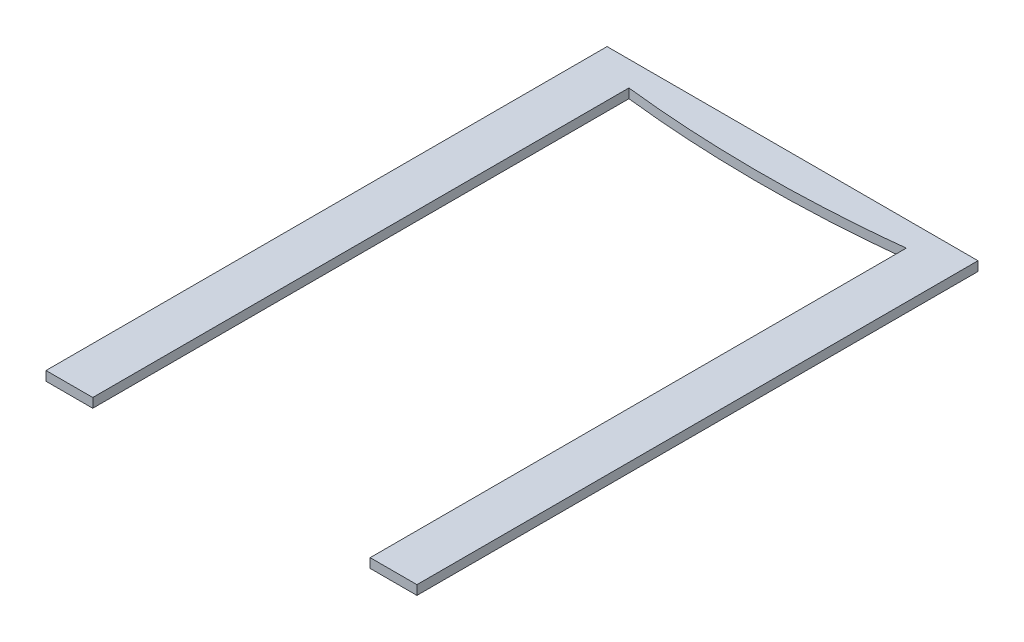
ISO-10303-21;
HEADER;
FILE_DESCRIPTION(('STEP AP214'),'2;1');
FILE_NAME('part.step','',(''),(''),'','','');
FILE_SCHEMA(('AUTOMOTIVE_DESIGN { 1 0 10303 214 1 1 1 1 }'));
ENDSEC;
DATA;
#1=APPLICATION_CONTEXT('core data for automotive mechanical design processes');
#2=APPLICATION_PROTOCOL_DEFINITION('international standard','automotive_design',2000,#1);
#3=PRODUCT_CONTEXT('',#1,'mechanical');
#4=PRODUCT('Part','Part','',(#3));
#5=PRODUCT_RELATED_PRODUCT_CATEGORY('part','',(#4));
#6=PRODUCT_DEFINITION_FORMATION('','',#4);
#7=PRODUCT_DEFINITION_CONTEXT('part definition',#1,'design');
#8=PRODUCT_DEFINITION('design','',#6,#7);
#9=PRODUCT_DEFINITION_SHAPE('','',#8);
#10=(LENGTH_UNIT() NAMED_UNIT(*) SI_UNIT(.MILLI.,.METRE.));
#11=(NAMED_UNIT(*) PLANE_ANGLE_UNIT() SI_UNIT($,.RADIAN.));
#12=(NAMED_UNIT(*) SI_UNIT($,.STERADIAN.) SOLID_ANGLE_UNIT());
#13=UNCERTAINTY_MEASURE_WITH_UNIT(LENGTH_MEASURE(1.E-05),#10,'distance_accuracy_value','');
#14=(GEOMETRIC_REPRESENTATION_CONTEXT(3) GLOBAL_UNCERTAINTY_ASSIGNED_CONTEXT((#13)) GLOBAL_UNIT_ASSIGNED_CONTEXT((#10,
#11,#12)) REPRESENTATION_CONTEXT('',''));
#15=CARTESIAN_POINT('',(0.,0.,0.));
#16=DIRECTION('',(0.,0.,1.));
#17=DIRECTION('',(1.,0.,0.));
#18=AXIS2_PLACEMENT_3D('',#15,#16,#17);
#19=CARTESIAN_POINT('',(-44.5,3.,90.));
#20=DIRECTION('',(0.,0.,-1.));
#21=DIRECTION('',(-1.,0.,0.));
#22=AXIS2_PLACEMENT_3D('',#19,#20,#21);
#23=PLANE('',#22);
#24=DIRECTION('',(1.,0.,0.));
#25=VECTOR('',#24,1.);
#26=CARTESIAN_POINT('',(-44.5,0.,90.));
#27=LINE('',#26,#25);
#28=CARTESIAN_POINT('',(-59.5,0.,90.));
#29=VERTEX_POINT('',#28);
#30=CARTESIAN_POINT('',(-44.5,0.,90.));
#31=VERTEX_POINT('',#30);
#32=EDGE_CURVE('E129',#29,#31,#27,.T.);
#33=ORIENTED_EDGE('',*,*,#32,.T.);
#34=DIRECTION('',(0.,-1.,0.));
#35=VECTOR('',#34,1.);
#36=CARTESIAN_POINT('',(-44.5,3.,90.));
#37=LINE('',#36,#35);
#38=CARTESIAN_POINT('',(-44.5,3.,90.));
#39=VERTEX_POINT('',#38);
#40=EDGE_CURVE('E11',#39,#31,#37,.T.);
#41=ORIENTED_EDGE('',*,*,#40,.F.);
#42=DIRECTION('',(1.,0.,0.));
#43=VECTOR('',#42,1.);
#44=CARTESIAN_POINT('',(-44.5,3.,90.));
#45=LINE('',#44,#43);
#46=CARTESIAN_POINT('',(-59.5,3.,90.));
#47=VERTEX_POINT('',#46);
#48=EDGE_CURVE('E148',#47,#39,#45,.T.);
#49=ORIENTED_EDGE('',*,*,#48,.F.);
#50=DIRECTION('',(0.,-1.,0.));
#51=VECTOR('',#50,1.);
#52=CARTESIAN_POINT('',(-59.5,3.,90.));
#53=LINE('',#52,#51);
#54=EDGE_CURVE('E125',#47,#29,#53,.T.);
#55=ORIENTED_EDGE('',*,*,#54,.T.);
#56=EDGE_LOOP('',(#33,#41,#49,#55));
#57=FACE_BOUND('',#56,.T.);
#58=ADVANCED_FACE('F33',(#57),#23,.F.);
#59=CARTESIAN_POINT('',(-44.5,3.,-82.));
#60=DIRECTION('',(-1.,0.,0.));
#61=DIRECTION('',(0.,0.,1.));
#62=AXIS2_PLACEMENT_3D('',#59,#60,#61);
#63=PLANE('',#62);
#64=DIRECTION('',(0.,0.,-1.));
#65=VECTOR('',#64,1.);
#66=CARTESIAN_POINT('',(-44.5,0.,-82.));
#67=LINE('',#66,#65);
#68=CARTESIAN_POINT('',(-44.5,0.,-82.));
#69=VERTEX_POINT('',#68);
#70=EDGE_CURVE('E132',#31,#69,#67,.T.);
#71=ORIENTED_EDGE('',*,*,#70,.T.);
#72=DIRECTION('',(0.,-1.,0.));
#73=VECTOR('',#72,1.);
#74=CARTESIAN_POINT('',(-44.5,3.,-82.));
#75=LINE('',#74,#73);
#76=CARTESIAN_POINT('',(-44.5,3.,-82.));
#77=VERTEX_POINT('',#76);
#78=EDGE_CURVE('E41',#77,#69,#75,.T.);
#79=ORIENTED_EDGE('',*,*,#78,.F.);
#80=DIRECTION('',(0.,0.,-1.));
#81=VECTOR('',#80,1.);
#82=CARTESIAN_POINT('',(-44.5,3.,-82.));
#83=LINE('',#82,#81);
#84=EDGE_CURVE('E92',#39,#77,#83,.T.);
#85=ORIENTED_EDGE('',*,*,#84,.F.);
#86=ORIENTED_EDGE('',*,*,#40,.T.);
#87=EDGE_LOOP('',(#71,#79,#85,#86));
#88=FACE_BOUND('',#87,.T.);
#89=ADVANCED_FACE('F189',(#88),#63,.F.);
#90=CARTESIAN_POINT('',(-44.5,3.,-82.));
#91=CARTESIAN_POINT('',(0.,3.,-77.));
#92=CARTESIAN_POINT('',(44.5,3.,-82.));
#93=B_SPLINE_CURVE_WITH_KNOTS('',2,(#90,#91,#92),.UNSPECIFIED.,.F.,.F.,(3,3),(0.,1.),.UNSPECIFIED.);
#94=DIRECTION('',(0.,-1.,0.));
#95=VECTOR('',#94,1.);
#96=SURFACE_OF_LINEAR_EXTRUSION('',#93,#95);
#97=CARTESIAN_POINT('',(-44.5,0.,-82.));
#98=CARTESIAN_POINT('',(0.,0.,-77.));
#99=CARTESIAN_POINT('',(44.5,0.,-82.));
#100=B_SPLINE_CURVE_WITH_KNOTS('',2,(#97,#98,#99),.UNSPECIFIED.,.F.,.F.,(3,3),(0.,1.),.UNSPECIFIED.);
#101=CARTESIAN_POINT('',(44.5,0.,-82.));
#102=VERTEX_POINT('',#101);
#103=EDGE_CURVE('E134',#69,#102,#100,.T.);
#104=ORIENTED_EDGE('',*,*,#103,.T.);
#105=DIRECTION('',(0.,-1.,0.));
#106=VECTOR('',#105,1.);
#107=CARTESIAN_POINT('',(44.5,3.,-82.));
#108=LINE('',#107,#106);
#109=CARTESIAN_POINT('',(44.5,3.,-82.));
#110=VERTEX_POINT('',#109);
#111=EDGE_CURVE('E155',#110,#102,#108,.T.);
#112=ORIENTED_EDGE('',*,*,#111,.F.);
#113=EDGE_CURVE('E163',#77,#110,#93,.T.);
#114=ORIENTED_EDGE('',*,*,#113,.F.);
#115=ORIENTED_EDGE('',*,*,#78,.T.);
#116=EDGE_LOOP('',(#104,#112,#114,#115));
#117=FACE_BOUND('',#116,.T.);
#118=ADVANCED_FACE('F161',(#117),#96,.F.);
#119=CARTESIAN_POINT('',(44.5,3.,90.));
#120=DIRECTION('',(1.,0.,0.));
#121=DIRECTION('',(0.,0.,-1.));
#122=AXIS2_PLACEMENT_3D('',#119,#120,#121);
#123=PLANE('',#122);
#124=DIRECTION('',(0.,0.,1.));
#125=VECTOR('',#124,1.);
#126=CARTESIAN_POINT('',(44.5,0.,90.));
#127=LINE('',#126,#125);
#128=CARTESIAN_POINT('',(44.5,0.,90.));
#129=VERTEX_POINT('',#128);
#130=EDGE_CURVE('E138',#102,#129,#127,.T.);
#131=ORIENTED_EDGE('',*,*,#130,.T.);
#132=DIRECTION('',(0.,-1.,0.));
#133=VECTOR('',#132,1.);
#134=CARTESIAN_POINT('',(44.5,3.,90.));
#135=LINE('',#134,#133);
#136=CARTESIAN_POINT('',(44.5,3.,90.));
#137=VERTEX_POINT('',#136);
#138=EDGE_CURVE('E152',#137,#129,#135,.T.);
#139=ORIENTED_EDGE('',*,*,#138,.F.);
#140=DIRECTION('',(0.,0.,1.));
#141=VECTOR('',#140,1.);
#142=CARTESIAN_POINT('',(44.5,3.,90.));
#143=LINE('',#142,#141);
#144=EDGE_CURVE('E175',#110,#137,#143,.T.);
#145=ORIENTED_EDGE('',*,*,#144,.F.);
#146=ORIENTED_EDGE('',*,*,#111,.T.);
#147=EDGE_LOOP('',(#131,#139,#145,#146));
#148=FACE_BOUND('',#147,.T.);
#149=ADVANCED_FACE('F171',(#148),#123,.F.);
#150=CARTESIAN_POINT('',(59.5,3.,90.));
#151=DIRECTION('',(0.,0.,-1.));
#152=DIRECTION('',(-1.,0.,0.));
#153=AXIS2_PLACEMENT_3D('',#150,#151,#152);
#154=PLANE('',#153);
#155=DIRECTION('',(1.,0.,0.));
#156=VECTOR('',#155,1.);
#157=CARTESIAN_POINT('',(59.5,0.,90.));
#158=LINE('',#157,#156);
#159=CARTESIAN_POINT('',(59.5,0.,90.));
#160=VERTEX_POINT('',#159);
#161=EDGE_CURVE('E143',#129,#160,#158,.T.);
#162=ORIENTED_EDGE('',*,*,#161,.T.);
#163=DIRECTION('',(0.,-1.,0.));
#164=VECTOR('',#163,1.);
#165=CARTESIAN_POINT('',(59.5,3.,90.));
#166=LINE('',#165,#164);
#167=CARTESIAN_POINT('',(59.5,3.,90.));
#168=VERTEX_POINT('',#167);
#169=EDGE_CURVE('E120',#168,#160,#166,.T.);
#170=ORIENTED_EDGE('',*,*,#169,.F.);
#171=DIRECTION('',(1.,0.,0.));
#172=VECTOR('',#171,1.);
#173=CARTESIAN_POINT('',(59.5,3.,90.));
#174=LINE('',#173,#172);
#175=EDGE_CURVE('E111',#137,#168,#174,.T.);
#176=ORIENTED_EDGE('',*,*,#175,.F.);
#177=ORIENTED_EDGE('',*,*,#138,.T.);
#178=EDGE_LOOP('',(#162,#170,#176,#177));
#179=FACE_BOUND('',#178,.T.);
#180=ADVANCED_FACE('F174',(#179),#154,.F.);
#181=CARTESIAN_POINT('',(59.5,3.,-90.));
#182=DIRECTION('',(-1.,0.,0.));
#183=DIRECTION('',(0.,0.,1.));
#184=AXIS2_PLACEMENT_3D('',#181,#182,#183);
#185=PLANE('',#184);
#186=DIRECTION('',(0.,0.,-1.));
#187=VECTOR('',#186,1.);
#188=CARTESIAN_POINT('',(59.5,0.,-90.));
#189=LINE('',#188,#187);
#190=CARTESIAN_POINT('',(59.5,0.,-90.));
#191=VERTEX_POINT('',#190);
#192=EDGE_CURVE('E119',#160,#191,#189,.T.);
#193=ORIENTED_EDGE('',*,*,#192,.T.);
#194=DIRECTION('',(0.,-1.,0.));
#195=VECTOR('',#194,1.);
#196=CARTESIAN_POINT('',(59.5,3.,-90.));
#197=LINE('',#196,#195);
#198=CARTESIAN_POINT('',(59.5,3.,-90.));
#199=VERTEX_POINT('',#198);
#200=EDGE_CURVE('E116',#199,#191,#197,.T.);
#201=ORIENTED_EDGE('',*,*,#200,.F.);
#202=DIRECTION('',(0.,0.,-1.));
#203=VECTOR('',#202,1.);
#204=CARTESIAN_POINT('',(59.5,3.,-90.));
#205=LINE('',#204,#203);
#206=EDGE_CURVE('E105',#168,#199,#205,.T.);
#207=ORIENTED_EDGE('',*,*,#206,.F.);
#208=ORIENTED_EDGE('',*,*,#169,.T.);
#209=EDGE_LOOP('',(#193,#201,#207,#208));
#210=FACE_BOUND('',#209,.T.);
#211=ADVANCED_FACE('F117',(#210),#185,.F.);
#212=CARTESIAN_POINT('',(-59.5,3.,-90.));
#213=DIRECTION('',(0.,0.,1.));
#214=DIRECTION('',(1.,0.,0.));
#215=AXIS2_PLACEMENT_3D('',#212,#213,#214);
#216=PLANE('',#215);
#217=DIRECTION('',(-1.,0.,0.));
#218=VECTOR('',#217,1.);
#219=CARTESIAN_POINT('',(-59.5,0.,-90.));
#220=LINE('',#219,#218);
#221=CARTESIAN_POINT('',(-59.5,0.,-90.));
#222=VERTEX_POINT('',#221);
#223=EDGE_CURVE('E78',#191,#222,#220,.T.);
#224=ORIENTED_EDGE('',*,*,#223,.T.);
#225=DIRECTION('',(0.,-1.,0.));
#226=VECTOR('',#225,1.);
#227=CARTESIAN_POINT('',(-59.5,3.,-90.));
#228=LINE('',#227,#226);
#229=CARTESIAN_POINT('',(-59.5,3.,-90.));
#230=VERTEX_POINT('',#229);
#231=EDGE_CURVE('E121',#230,#222,#228,.T.);
#232=ORIENTED_EDGE('',*,*,#231,.F.);
#233=DIRECTION('',(-1.,0.,0.));
#234=VECTOR('',#233,1.);
#235=CARTESIAN_POINT('',(-59.5,3.,-90.));
#236=LINE('',#235,#234);
#237=EDGE_CURVE('E109',#199,#230,#236,.T.);
#238=ORIENTED_EDGE('',*,*,#237,.F.);
#239=ORIENTED_EDGE('',*,*,#200,.T.);
#240=EDGE_LOOP('',(#224,#232,#238,#239));
#241=FACE_BOUND('',#240,.T.);
#242=ADVANCED_FACE('F123',(#241),#216,.F.);
#243=CARTESIAN_POINT('',(-59.5,3.,90.));
#244=DIRECTION('',(1.,0.,0.));
#245=DIRECTION('',(0.,0.,-1.));
#246=AXIS2_PLACEMENT_3D('',#243,#244,#245);
#247=PLANE('',#246);
#248=DIRECTION('',(0.,0.,1.));
#249=VECTOR('',#248,1.);
#250=CARTESIAN_POINT('',(-59.5,0.,90.));
#251=LINE('',#250,#249);
#252=EDGE_CURVE('E84',#222,#29,#251,.T.);
#253=ORIENTED_EDGE('',*,*,#252,.T.);
#254=ORIENTED_EDGE('',*,*,#54,.F.);
#255=DIRECTION('',(0.,0.,1.));
#256=VECTOR('',#255,1.);
#257=CARTESIAN_POINT('',(-59.5,3.,90.));
#258=LINE('',#257,#256);
#259=EDGE_CURVE('E49',#230,#47,#258,.T.);
#260=ORIENTED_EDGE('',*,*,#259,.F.);
#261=ORIENTED_EDGE('',*,*,#231,.T.);
#262=EDGE_LOOP('',(#253,#254,#260,#261));
#263=FACE_BOUND('',#262,.T.);
#264=ADVANCED_FACE('F198',(#263),#247,.F.);
#265=CARTESIAN_POINT('',(0.,3.,-79.5));
#266=DIRECTION('',(0.,-1.,0.));
#267=DIRECTION('',(0.,0.,-1.));
#268=AXIS2_PLACEMENT_3D('',#265,#266,#267);
#269=PLANE('',#268);
#270=ORIENTED_EDGE('',*,*,#48,.T.);
#271=ORIENTED_EDGE('',*,*,#84,.T.);
#272=ORIENTED_EDGE('',*,*,#113,.T.);
#273=ORIENTED_EDGE('',*,*,#144,.T.);
#274=ORIENTED_EDGE('',*,*,#175,.T.);
#275=ORIENTED_EDGE('',*,*,#206,.T.);
#276=ORIENTED_EDGE('',*,*,#237,.T.);
#277=ORIENTED_EDGE('',*,*,#259,.T.);
#278=EDGE_LOOP('',(#270,#271,#272,#273,#274,#275,#276,#277));
#279=FACE_BOUND('',#278,.T.);
#280=ADVANCED_FACE('F107',(#279),#269,.F.);
#281=CARTESIAN_POINT('',(0.,0.,-79.5));
#282=DIRECTION('',(0.,-1.,0.));
#283=DIRECTION('',(0.,0.,-1.));
#284=AXIS2_PLACEMENT_3D('',#281,#282,#283);
#285=PLANE('',#284);
#286=ORIENTED_EDGE('',*,*,#32,.F.);
#287=ORIENTED_EDGE('',*,*,#252,.F.);
#288=ORIENTED_EDGE('',*,*,#223,.F.);
#289=ORIENTED_EDGE('',*,*,#192,.F.);
#290=ORIENTED_EDGE('',*,*,#161,.F.);
#291=ORIENTED_EDGE('',*,*,#130,.F.);
#292=ORIENTED_EDGE('',*,*,#103,.F.);
#293=ORIENTED_EDGE('',*,*,#70,.F.);
#294=EDGE_LOOP('',(#286,#287,#288,#289,#290,#291,#292,#293));
#295=FACE_BOUND('',#294,.T.);
#296=ADVANCED_FACE('F167',(#295),#285,.T.);
#297=CLOSED_SHELL('',(#58,#89,#118,#149,#180,#211,#242,#264,#280,#296));
#298=MANIFOLD_SOLID_BREP('B2',#297);
#299=ADVANCED_BREP_SHAPE_REPRESENTATION('',(#18,#298),#14);
#300=SHAPE_DEFINITION_REPRESENTATION(#9,#299);
ENDSEC;
END-ISO-10303-21;
